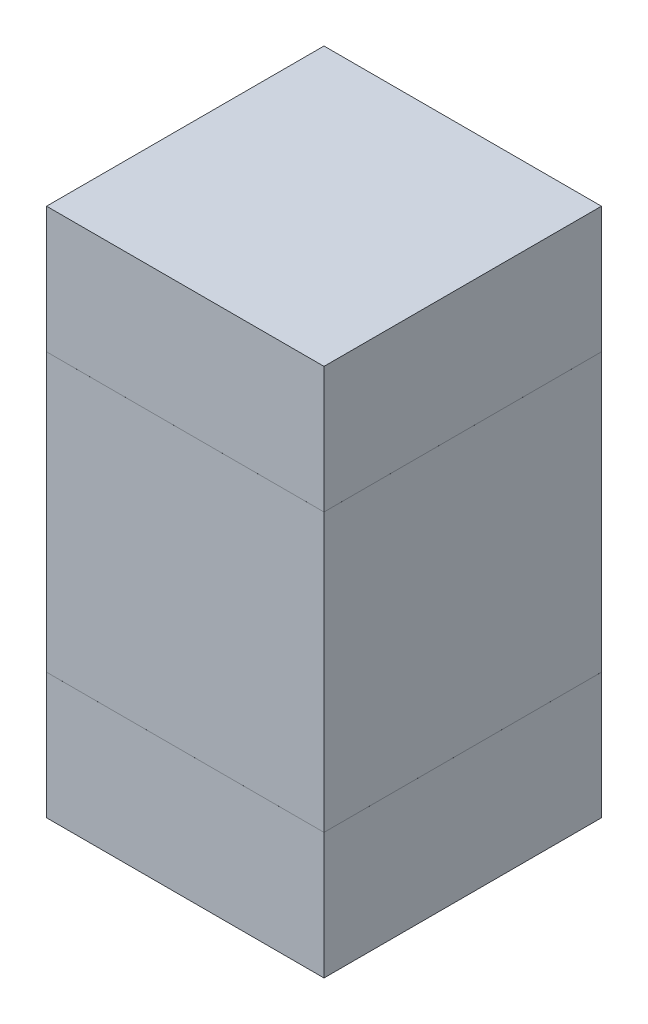
ISO-10303-21;
HEADER;
FILE_DESCRIPTION(('STEP AP214'),'2;1');
FILE_NAME('part.step','',(''),(''),'','','');
FILE_SCHEMA(('AUTOMOTIVE_DESIGN { 1 0 10303 214 1 1 1 1 }'));
ENDSEC;
DATA;
#1=APPLICATION_CONTEXT('core data for automotive mechanical design processes');
#2=APPLICATION_PROTOCOL_DEFINITION('international standard','automotive_design',2000,#1);
#3=PRODUCT_CONTEXT('',#1,'mechanical');
#4=PRODUCT('Part','Part','',(#3));
#5=PRODUCT_RELATED_PRODUCT_CATEGORY('part','',(#4));
#6=PRODUCT_DEFINITION_FORMATION('','',#4);
#7=PRODUCT_DEFINITION_CONTEXT('part definition',#1,'design');
#8=PRODUCT_DEFINITION('design','',#6,#7);
#9=PRODUCT_DEFINITION_SHAPE('','',#8);
#10=(LENGTH_UNIT() NAMED_UNIT(*) SI_UNIT(.MILLI.,.METRE.));
#11=(NAMED_UNIT(*) PLANE_ANGLE_UNIT() SI_UNIT($,.RADIAN.));
#12=(NAMED_UNIT(*) SI_UNIT($,.STERADIAN.) SOLID_ANGLE_UNIT());
#13=UNCERTAINTY_MEASURE_WITH_UNIT(LENGTH_MEASURE(1.E-05),#10,'distance_accuracy_value','');
#14=(GEOMETRIC_REPRESENTATION_CONTEXT(3) GLOBAL_UNCERTAINTY_ASSIGNED_CONTEXT((#13)) GLOBAL_UNIT_ASSIGNED_CONTEXT((#10,
#11,#12)) REPRESENTATION_CONTEXT('',''));
#15=CARTESIAN_POINT('',(0.,0.,0.));
#16=DIRECTION('',(0.,0.,1.));
#17=DIRECTION('',(1.,0.,0.));
#18=AXIS2_PLACEMENT_3D('',#15,#16,#17);
#19=CARTESIAN_POINT('',(1.810006232969,13.334994287031,0.32999934));
#20=DIRECTION('',(0.,0.,-1.));
#21=DIRECTION('',(0.,-1.,0.));
#22=AXIS2_PLACEMENT_3D('',#19,#20,#21);
#23=PLANE('',#22);
#24=DIRECTION('',(1.,0.,0.));
#25=VECTOR('',#24,1.);
#26=CARTESIAN_POINT('',(1.810006232969,13.334994287031,0.32999934));
#27=LINE('',#26,#25);
#28=CARTESIAN_POINT('',(1.810006232969,13.334994287031,0.32999934));
#29=VERTEX_POINT('',#28);
#30=CARTESIAN_POINT('',(2.140008112969,13.334994287031,0.32999934));
#31=VERTEX_POINT('',#30);
#32=EDGE_CURVE('P0_E75',#29,#31,#27,.T.);
#33=ORIENTED_EDGE('',*,*,#32,.T.);
#34=DIRECTION('',(0.,1.,0.));
#35=VECTOR('',#34,1.);
#36=CARTESIAN_POINT('',(2.140008112969,13.334994287031,0.32999934));
#37=LINE('',#36,#35);
#38=CARTESIAN_POINT('',(2.140008112969,13.484993987031,0.32999934));
#39=VERTEX_POINT('',#38);
#40=EDGE_CURVE('P0_E73',#31,#39,#37,.T.);
#41=ORIENTED_EDGE('',*,*,#40,.T.);
#42=DIRECTION('',(-1.,0.,0.));
#43=VECTOR('',#42,1.);
#44=CARTESIAN_POINT('',(2.140008112969,13.484993987031,0.32999934));
#45=LINE('',#44,#43);
#46=CARTESIAN_POINT('',(1.810006232969,13.484993987031,0.32999934));
#47=VERTEX_POINT('',#46);
#48=EDGE_CURVE('P0_E61',#39,#47,#45,.T.);
#49=ORIENTED_EDGE('',*,*,#48,.T.);
#50=DIRECTION('',(0.,-1.,0.));
#51=VECTOR('',#50,1.);
#52=CARTESIAN_POINT('',(1.810006232969,13.484993987031,0.32999934));
#53=LINE('',#52,#51);
#54=EDGE_CURVE('P0_E11',#47,#29,#53,.T.);
#55=ORIENTED_EDGE('',*,*,#54,.T.);
#56=EDGE_LOOP('',(#33,#41,#49,#55));
#57=FACE_BOUND('',#56,.T.);
#58=ADVANCED_FACE('P0_F17',(#57),#23,.F.);
#59=CARTESIAN_POINT('',(1.810006232969,13.334994287031,0.));
#60=DIRECTION('',(0.,0.,-1.));
#61=DIRECTION('',(0.,-1.,0.));
#62=AXIS2_PLACEMENT_3D('',#59,#60,#61);
#63=PLANE('',#62);
#64=DIRECTION('',(0.,-1.,0.));
#65=VECTOR('',#64,1.);
#66=CARTESIAN_POINT('',(1.810006232969,13.484993987031,0.));
#67=LINE('',#66,#65);
#68=CARTESIAN_POINT('',(1.810006232969,13.484993987031,0.));
#69=VERTEX_POINT('',#68);
#70=CARTESIAN_POINT('',(1.810006232969,13.334994287031,0.));
#71=VERTEX_POINT('',#70);
#72=EDGE_CURVE('P0_E20',#69,#71,#67,.T.);
#73=ORIENTED_EDGE('',*,*,#72,.F.);
#74=DIRECTION('',(-1.,0.,0.));
#75=VECTOR('',#74,1.);
#76=CARTESIAN_POINT('',(2.140008112969,13.484993987031,0.));
#77=LINE('',#76,#75);
#78=CARTESIAN_POINT('',(2.140008112969,13.484993987031,0.));
#79=VERTEX_POINT('',#78);
#80=EDGE_CURVE('P0_E80',#79,#69,#77,.T.);
#81=ORIENTED_EDGE('',*,*,#80,.F.);
#82=DIRECTION('',(0.,1.,0.));
#83=VECTOR('',#82,1.);
#84=CARTESIAN_POINT('',(2.140008112969,13.334994287031,0.));
#85=LINE('',#84,#83);
#86=CARTESIAN_POINT('',(2.140008112969,13.334994287031,0.));
#87=VERTEX_POINT('',#86);
#88=EDGE_CURVE('P0_E83',#87,#79,#85,.T.);
#89=ORIENTED_EDGE('',*,*,#88,.F.);
#90=DIRECTION('',(1.,0.,0.));
#91=VECTOR('',#90,1.);
#92=CARTESIAN_POINT('',(1.810006232969,13.334994287031,0.));
#93=LINE('',#92,#91);
#94=EDGE_CURVE('P0_E96',#71,#87,#93,.T.);
#95=ORIENTED_EDGE('',*,*,#94,.F.);
#96=EDGE_LOOP('',(#73,#81,#89,#95));
#97=FACE_BOUND('',#96,.T.);
#98=ADVANCED_FACE('P0_F112',(#97),#63,.T.);
#99=CARTESIAN_POINT('',(1.810006232969,13.484993987031,0.));
#100=DIRECTION('',(1.,0.,0.));
#101=DIRECTION('',(0.,1.,0.));
#102=AXIS2_PLACEMENT_3D('',#99,#100,#101);
#103=PLANE('',#102);
#104=ORIENTED_EDGE('',*,*,#72,.T.);
#105=DIRECTION('',(0.,0.,1.));
#106=VECTOR('',#105,1.);
#107=CARTESIAN_POINT('',(1.810006232969,13.334994287031,0.));
#108=LINE('',#107,#106);
#109=EDGE_CURVE('P0_E88',#71,#29,#108,.T.);
#110=ORIENTED_EDGE('',*,*,#109,.T.);
#111=ORIENTED_EDGE('',*,*,#54,.F.);
#112=DIRECTION('',(0.,0.,1.));
#113=VECTOR('',#112,1.);
#114=CARTESIAN_POINT('',(1.810006232969,13.484993987031,0.));
#115=LINE('',#114,#113);
#116=EDGE_CURVE('P0_E68',#69,#47,#115,.T.);
#117=ORIENTED_EDGE('',*,*,#116,.F.);
#118=EDGE_LOOP('',(#104,#110,#111,#117));
#119=FACE_BOUND('',#118,.T.);
#120=ADVANCED_FACE('P0_F117',(#119),#103,.F.);
#121=CARTESIAN_POINT('',(2.140008112969,13.484993987031,0.));
#122=DIRECTION('',(0.,-1.,0.));
#123=DIRECTION('',(0.,0.,-1.));
#124=AXIS2_PLACEMENT_3D('',#121,#122,#123);
#125=PLANE('',#124);
#126=ORIENTED_EDGE('',*,*,#80,.T.);
#127=ORIENTED_EDGE('',*,*,#116,.T.);
#128=ORIENTED_EDGE('',*,*,#48,.F.);
#129=DIRECTION('',(0.,0.,1.));
#130=VECTOR('',#129,1.);
#131=CARTESIAN_POINT('',(2.140008112969,13.484993987031,0.));
#132=LINE('',#131,#130);
#133=EDGE_CURVE('P0_E66',#79,#39,#132,.T.);
#134=ORIENTED_EDGE('',*,*,#133,.F.);
#135=EDGE_LOOP('',(#126,#127,#128,#134));
#136=FACE_BOUND('',#135,.T.);
#137=ADVANCED_FACE('P0_F64',(#136),#125,.F.);
#138=CARTESIAN_POINT('',(2.140008112969,13.334994287031,0.));
#139=DIRECTION('',(-1.,0.,0.));
#140=DIRECTION('',(0.,0.,1.));
#141=AXIS2_PLACEMENT_3D('',#138,#139,#140);
#142=PLANE('',#141);
#143=ORIENTED_EDGE('',*,*,#88,.T.);
#144=ORIENTED_EDGE('',*,*,#133,.T.);
#145=ORIENTED_EDGE('',*,*,#40,.F.);
#146=DIRECTION('',(0.,0.,1.));
#147=VECTOR('',#146,1.);
#148=CARTESIAN_POINT('',(2.140008112969,13.334994287031,0.));
#149=LINE('',#148,#147);
#150=EDGE_CURVE('P0_E93',#87,#31,#149,.T.);
#151=ORIENTED_EDGE('',*,*,#150,.F.);
#152=EDGE_LOOP('',(#143,#144,#145,#151));
#153=FACE_BOUND('',#152,.T.);
#154=ADVANCED_FACE('P0_F81',(#153),#142,.F.);
#155=CARTESIAN_POINT('',(1.810006232969,13.334994287031,0.));
#156=DIRECTION('',(0.,1.,0.));
#157=DIRECTION('',(1.,0.,0.));
#158=AXIS2_PLACEMENT_3D('',#155,#156,#157);
#159=PLANE('',#158);
#160=ORIENTED_EDGE('',*,*,#94,.T.);
#161=ORIENTED_EDGE('',*,*,#150,.T.);
#162=ORIENTED_EDGE('',*,*,#32,.F.);
#163=ORIENTED_EDGE('',*,*,#109,.F.);
#164=EDGE_LOOP('',(#160,#161,#162,#163));
#165=FACE_BOUND('',#164,.T.);
#166=ADVANCED_FACE('P0_F109',(#165),#159,.F.);
#167=CLOSED_SHELL('',(#58,#98,#120,#137,#154,#166));
#168=MANIFOLD_SOLID_BREP('P0_B1',#167);
#169=CARTESIAN_POINT('',(1.810006232969,13.815005273359,0.32999934));
#170=DIRECTION('',(0.,0.,-1.));
#171=DIRECTION('',(0.,-1.,0.));
#172=AXIS2_PLACEMENT_3D('',#169,#170,#171);
#173=PLANE('',#172);
#174=DIRECTION('',(1.,0.,0.));
#175=VECTOR('',#174,1.);
#176=CARTESIAN_POINT('',(1.810006232969,13.815005273359,0.32999934));
#177=LINE('',#176,#175);
#178=CARTESIAN_POINT('',(1.810006232969,13.815005273359,0.32999934));
#179=VERTEX_POINT('',#178);
#180=CARTESIAN_POINT('',(2.140008112969,13.815005273359,0.32999934));
#181=VERTEX_POINT('',#180);
#182=EDGE_CURVE('P1_E95',#179,#181,#177,.T.);
#183=ORIENTED_EDGE('',*,*,#182,.T.);
#184=DIRECTION('',(0.,1.,0.));
#185=VECTOR('',#184,1.);
#186=CARTESIAN_POINT('',(2.140008112969,13.815005273359,0.32999934));
#187=LINE('',#186,#185);
#188=CARTESIAN_POINT('',(2.140008112969,13.965004973359,0.32999934));
#189=VERTEX_POINT('',#188);
#190=EDGE_CURVE('P1_E75',#181,#189,#187,.T.);
#191=ORIENTED_EDGE('',*,*,#190,.T.);
#192=DIRECTION('',(-1.,0.,0.));
#193=VECTOR('',#192,1.);
#194=CARTESIAN_POINT('',(2.140008112969,13.965004973359,0.32999934));
#195=LINE('',#194,#193);
#196=CARTESIAN_POINT('',(1.810006232969,13.965004973359,0.32999934));
#197=VERTEX_POINT('',#196);
#198=EDGE_CURVE('P1_E80',#189,#197,#195,.T.);
#199=ORIENTED_EDGE('',*,*,#198,.T.);
#200=DIRECTION('',(0.,-1.,0.));
#201=VECTOR('',#200,1.);
#202=CARTESIAN_POINT('',(1.810006232969,13.965004973359,0.32999934));
#203=LINE('',#202,#201);
#204=EDGE_CURVE('P1_E11',#197,#179,#203,.T.);
#205=ORIENTED_EDGE('',*,*,#204,.T.);
#206=EDGE_LOOP('',(#183,#191,#199,#205));
#207=FACE_BOUND('',#206,.T.);
#208=ADVANCED_FACE('P1_F17',(#207),#173,.F.);
#209=CARTESIAN_POINT('',(1.810006232969,13.815005273359,0.));
#210=DIRECTION('',(0.,0.,-1.));
#211=DIRECTION('',(0.,-1.,0.));
#212=AXIS2_PLACEMENT_3D('',#209,#210,#211);
#213=PLANE('',#212);
#214=DIRECTION('',(0.,-1.,0.));
#215=VECTOR('',#214,1.);
#216=CARTESIAN_POINT('',(1.810006232969,13.965004973359,0.));
#217=LINE('',#216,#215);
#218=CARTESIAN_POINT('',(1.810006232969,13.965004973359,0.));
#219=VERTEX_POINT('',#218);
#220=CARTESIAN_POINT('',(1.810006232969,13.815005273359,0.));
#221=VERTEX_POINT('',#220);
#222=EDGE_CURVE('P1_E25',#219,#221,#217,.T.);
#223=ORIENTED_EDGE('',*,*,#222,.F.);
#224=DIRECTION('',(-1.,0.,0.));
#225=VECTOR('',#224,1.);
#226=CARTESIAN_POINT('',(2.140008112969,13.965004973359,0.));
#227=LINE('',#226,#225);
#228=CARTESIAN_POINT('',(2.140008112969,13.965004973359,0.));
#229=VERTEX_POINT('',#228);
#230=EDGE_CURVE('P1_E65',#229,#219,#227,.T.);
#231=ORIENTED_EDGE('',*,*,#230,.F.);
#232=DIRECTION('',(0.,1.,0.));
#233=VECTOR('',#232,1.);
#234=CARTESIAN_POINT('',(2.140008112969,13.815005273359,0.));
#235=LINE('',#234,#233);
#236=CARTESIAN_POINT('',(2.140008112969,13.815005273359,0.));
#237=VERTEX_POINT('',#236);
#238=EDGE_CURVE('P1_E69',#237,#229,#235,.T.);
#239=ORIENTED_EDGE('',*,*,#238,.F.);
#240=DIRECTION('',(1.,0.,0.));
#241=VECTOR('',#240,1.);
#242=CARTESIAN_POINT('',(1.810006232969,13.815005273359,0.));
#243=LINE('',#242,#241);
#244=EDGE_CURVE('P1_E110',#221,#237,#243,.T.);
#245=ORIENTED_EDGE('',*,*,#244,.F.);
#246=EDGE_LOOP('',(#223,#231,#239,#245));
#247=FACE_BOUND('',#246,.T.);
#248=ADVANCED_FACE('P1_F67',(#247),#213,.T.);
#249=CARTESIAN_POINT('',(1.810006232969,13.965004973359,0.));
#250=DIRECTION('',(1.,0.,0.));
#251=DIRECTION('',(0.,1.,0.));
#252=AXIS2_PLACEMENT_3D('',#249,#250,#251);
#253=PLANE('',#252);
#254=ORIENTED_EDGE('',*,*,#222,.T.);
#255=DIRECTION('',(0.,0.,1.));
#256=VECTOR('',#255,1.);
#257=CARTESIAN_POINT('',(1.810006232969,13.815005273359,0.));
#258=LINE('',#257,#256);
#259=EDGE_CURVE('P1_E90',#221,#179,#258,.T.);
#260=ORIENTED_EDGE('',*,*,#259,.T.);
#261=ORIENTED_EDGE('',*,*,#204,.F.);
#262=DIRECTION('',(0.,0.,1.));
#263=VECTOR('',#262,1.);
#264=CARTESIAN_POINT('',(1.810006232969,13.965004973359,0.));
#265=LINE('',#264,#263);
#266=EDGE_CURVE('P1_E74',#219,#197,#265,.T.);
#267=ORIENTED_EDGE('',*,*,#266,.F.);
#268=EDGE_LOOP('',(#254,#260,#261,#267));
#269=FACE_BOUND('',#268,.T.);
#270=ADVANCED_FACE('P1_F106',(#269),#253,.F.);
#271=CARTESIAN_POINT('',(2.140008112969,13.965004973359,0.));
#272=DIRECTION('',(0.,-1.,0.));
#273=DIRECTION('',(0.,0.,-1.));
#274=AXIS2_PLACEMENT_3D('',#271,#272,#273);
#275=PLANE('',#274);
#276=ORIENTED_EDGE('',*,*,#230,.T.);
#277=ORIENTED_EDGE('',*,*,#266,.T.);
#278=ORIENTED_EDGE('',*,*,#198,.F.);
#279=DIRECTION('',(0.,0.,1.));
#280=VECTOR('',#279,1.);
#281=CARTESIAN_POINT('',(2.140008112969,13.965004973359,0.));
#282=LINE('',#281,#280);
#283=EDGE_CURVE('P1_E78',#229,#189,#282,.T.);
#284=ORIENTED_EDGE('',*,*,#283,.F.);
#285=EDGE_LOOP('',(#276,#277,#278,#284));
#286=FACE_BOUND('',#285,.T.);
#287=ADVANCED_FACE('P1_F79',(#286),#275,.F.);
#288=CARTESIAN_POINT('',(2.140008112969,13.815005273359,0.));
#289=DIRECTION('',(-1.,0.,0.));
#290=DIRECTION('',(0.,0.,1.));
#291=AXIS2_PLACEMENT_3D('',#288,#289,#290);
#292=PLANE('',#291);
#293=ORIENTED_EDGE('',*,*,#238,.T.);
#294=ORIENTED_EDGE('',*,*,#283,.T.);
#295=ORIENTED_EDGE('',*,*,#190,.F.);
#296=DIRECTION('',(0.,0.,1.));
#297=VECTOR('',#296,1.);
#298=CARTESIAN_POINT('',(2.140008112969,13.815005273359,0.));
#299=LINE('',#298,#297);
#300=EDGE_CURVE('P1_E87',#237,#181,#299,.T.);
#301=ORIENTED_EDGE('',*,*,#300,.F.);
#302=EDGE_LOOP('',(#293,#294,#295,#301));
#303=FACE_BOUND('',#302,.T.);
#304=ADVANCED_FACE('P1_F85',(#303),#292,.F.);
#305=CARTESIAN_POINT('',(1.810006232969,13.815005273359,0.));
#306=DIRECTION('',(0.,1.,0.));
#307=DIRECTION('',(1.,0.,0.));
#308=AXIS2_PLACEMENT_3D('',#305,#306,#307);
#309=PLANE('',#308);
#310=ORIENTED_EDGE('',*,*,#244,.T.);
#311=ORIENTED_EDGE('',*,*,#300,.T.);
#312=ORIENTED_EDGE('',*,*,#182,.F.);
#313=ORIENTED_EDGE('',*,*,#259,.F.);
#314=EDGE_LOOP('',(#310,#311,#312,#313));
#315=FACE_BOUND('',#314,.T.);
#316=ADVANCED_FACE('P1_F109',(#315),#309,.F.);
#317=CLOSED_SHELL('',(#208,#248,#270,#287,#304,#316));
#318=MANIFOLD_SOLID_BREP('P1_B1',#317);
#319=CARTESIAN_POINT('',(1.810006232969,13.484999960195,0.32999934));
#320=DIRECTION('',(0.,0.,-1.));
#321=DIRECTION('',(0.,-1.,0.));
#322=AXIS2_PLACEMENT_3D('',#319,#320,#321);
#323=PLANE('',#322);
#324=DIRECTION('',(1.,0.,0.));
#325=VECTOR('',#324,1.);
#326=CARTESIAN_POINT('',(1.810006232969,13.484999960195,0.32999934));
#327=LINE('',#326,#325);
#328=CARTESIAN_POINT('',(1.810006232969,13.484999960195,0.32999934));
#329=VERTEX_POINT('',#328);
#330=CARTESIAN_POINT('',(2.140008112969,13.484999960195,0.32999934));
#331=VERTEX_POINT('',#330);
#332=EDGE_CURVE('P2_E81',#329,#331,#327,.T.);
#333=ORIENTED_EDGE('',*,*,#332,.T.);
#334=DIRECTION('',(0.,1.,0.));
#335=VECTOR('',#334,1.);
#336=CARTESIAN_POINT('',(2.140008112969,13.484999960195,0.32999934));
#337=LINE('',#336,#335);
#338=CARTESIAN_POINT('',(2.140008112969,13.814999300195,0.32999934));
#339=VERTEX_POINT('',#338);
#340=EDGE_CURVE('P2_E104',#331,#339,#337,.T.);
#341=ORIENTED_EDGE('',*,*,#340,.T.);
#342=DIRECTION('',(-1.,0.,0.));
#343=VECTOR('',#342,1.);
#344=CARTESIAN_POINT('',(2.140008112969,13.814999300195,0.32999934));
#345=LINE('',#344,#343);
#346=CARTESIAN_POINT('',(1.810006232969,13.814999300195,0.32999934));
#347=VERTEX_POINT('',#346);
#348=EDGE_CURVE('P2_E74',#339,#347,#345,.T.);
#349=ORIENTED_EDGE('',*,*,#348,.T.);
#350=DIRECTION('',(0.,-1.,0.));
#351=VECTOR('',#350,1.);
#352=CARTESIAN_POINT('',(1.810006232969,13.814999300195,0.32999934));
#353=LINE('',#352,#351);
#354=EDGE_CURVE('P2_E11',#347,#329,#353,.T.);
#355=ORIENTED_EDGE('',*,*,#354,.T.);
#356=EDGE_LOOP('',(#333,#341,#349,#355));
#357=FACE_BOUND('',#356,.T.);
#358=ADVANCED_FACE('P2_F17',(#357),#323,.F.);
#359=CARTESIAN_POINT('',(1.810006232969,13.484999960195,0.));
#360=DIRECTION('',(0.,0.,-1.));
#361=DIRECTION('',(0.,-1.,0.));
#362=AXIS2_PLACEMENT_3D('',#359,#360,#361);
#363=PLANE('',#362);
#364=DIRECTION('',(0.,-1.,0.));
#365=VECTOR('',#364,1.);
#366=CARTESIAN_POINT('',(1.810006232969,13.814999300195,0.));
#367=LINE('',#366,#365);
#368=CARTESIAN_POINT('',(1.810006232969,13.814999300195,0.));
#369=VERTEX_POINT('',#368);
#370=CARTESIAN_POINT('',(1.810006232969,13.484999960195,0.));
#371=VERTEX_POINT('',#370);
#372=EDGE_CURVE('P2_E20',#369,#371,#367,.T.);
#373=ORIENTED_EDGE('',*,*,#372,.F.);
#374=DIRECTION('',(-1.,0.,0.));
#375=VECTOR('',#374,1.);
#376=CARTESIAN_POINT('',(2.140008112969,13.814999300195,0.));
#377=LINE('',#376,#375);
#378=CARTESIAN_POINT('',(2.140008112969,13.814999300195,0.));
#379=VERTEX_POINT('',#378);
#380=EDGE_CURVE('P2_E101',#379,#369,#377,.T.);
#381=ORIENTED_EDGE('',*,*,#380,.F.);
#382=DIRECTION('',(0.,1.,0.));
#383=VECTOR('',#382,1.);
#384=CARTESIAN_POINT('',(2.140008112969,13.484999960195,0.));
#385=LINE('',#384,#383);
#386=CARTESIAN_POINT('',(2.140008112969,13.484999960195,0.));
#387=VERTEX_POINT('',#386);
#388=EDGE_CURVE('P2_E83',#387,#379,#385,.T.);
#389=ORIENTED_EDGE('',*,*,#388,.F.);
#390=DIRECTION('',(1.,0.,0.));
#391=VECTOR('',#390,1.);
#392=CARTESIAN_POINT('',(1.810006232969,13.484999960195,0.));
#393=LINE('',#392,#391);
#394=EDGE_CURVE('P2_E79',#371,#387,#393,.T.);
#395=ORIENTED_EDGE('',*,*,#394,.F.);
#396=EDGE_LOOP('',(#373,#381,#389,#395));
#397=FACE_BOUND('',#396,.T.);
#398=ADVANCED_FACE('P2_F85',(#397),#363,.T.);
#399=CARTESIAN_POINT('',(1.810006232969,13.814999300195,0.));
#400=DIRECTION('',(1.,0.,0.));
#401=DIRECTION('',(0.,1.,0.));
#402=AXIS2_PLACEMENT_3D('',#399,#400,#401);
#403=PLANE('',#402);
#404=ORIENTED_EDGE('',*,*,#372,.T.);
#405=DIRECTION('',(0.,0.,1.));
#406=VECTOR('',#405,1.);
#407=CARTESIAN_POINT('',(1.810006232969,13.484999960195,0.));
#408=LINE('',#407,#406);
#409=EDGE_CURVE('P2_E68',#371,#329,#408,.T.);
#410=ORIENTED_EDGE('',*,*,#409,.T.);
#411=ORIENTED_EDGE('',*,*,#354,.F.);
#412=DIRECTION('',(0.,0.,1.));
#413=VECTOR('',#412,1.);
#414=CARTESIAN_POINT('',(1.810006232969,13.814999300195,0.));
#415=LINE('',#414,#413);
#416=EDGE_CURVE('P2_E71',#369,#347,#415,.T.);
#417=ORIENTED_EDGE('',*,*,#416,.F.);
#418=EDGE_LOOP('',(#404,#410,#411,#417));
#419=FACE_BOUND('',#418,.T.);
#420=ADVANCED_FACE('P2_F67',(#419),#403,.F.);
#421=CARTESIAN_POINT('',(2.140008112969,13.814999300195,0.));
#422=DIRECTION('',(0.,-1.,0.));
#423=DIRECTION('',(0.,0.,-1.));
#424=AXIS2_PLACEMENT_3D('',#421,#422,#423);
#425=PLANE('',#424);
#426=ORIENTED_EDGE('',*,*,#380,.T.);
#427=ORIENTED_EDGE('',*,*,#416,.T.);
#428=ORIENTED_EDGE('',*,*,#348,.F.);
#429=DIRECTION('',(0.,0.,1.));
#430=VECTOR('',#429,1.);
#431=CARTESIAN_POINT('',(2.140008112969,13.814999300195,0.));
#432=LINE('',#431,#430);
#433=EDGE_CURVE('P2_E100',#379,#339,#432,.T.);
#434=ORIENTED_EDGE('',*,*,#433,.F.);
#435=EDGE_LOOP('',(#426,#427,#428,#434));
#436=FACE_BOUND('',#435,.T.);
#437=ADVANCED_FACE('P2_F118',(#436),#425,.F.);
#438=CARTESIAN_POINT('',(2.140008112969,13.484999960195,0.));
#439=DIRECTION('',(-1.,0.,0.));
#440=DIRECTION('',(0.,0.,1.));
#441=AXIS2_PLACEMENT_3D('',#438,#439,#440);
#442=PLANE('',#441);
#443=ORIENTED_EDGE('',*,*,#388,.T.);
#444=ORIENTED_EDGE('',*,*,#433,.T.);
#445=ORIENTED_EDGE('',*,*,#340,.F.);
#446=DIRECTION('',(0.,0.,1.));
#447=VECTOR('',#446,1.);
#448=CARTESIAN_POINT('',(2.140008112969,13.484999960195,0.));
#449=LINE('',#448,#447);
#450=EDGE_CURVE('P2_E89',#387,#331,#449,.T.);
#451=ORIENTED_EDGE('',*,*,#450,.F.);
#452=EDGE_LOOP('',(#443,#444,#445,#451));
#453=FACE_BOUND('',#452,.T.);
#454=ADVANCED_FACE('P2_F120',(#453),#442,.F.);
#455=CARTESIAN_POINT('',(1.810006232969,13.484999960195,0.));
#456=DIRECTION('',(0.,1.,0.));
#457=DIRECTION('',(1.,0.,0.));
#458=AXIS2_PLACEMENT_3D('',#455,#456,#457);
#459=PLANE('',#458);
#460=ORIENTED_EDGE('',*,*,#394,.T.);
#461=ORIENTED_EDGE('',*,*,#450,.T.);
#462=ORIENTED_EDGE('',*,*,#332,.F.);
#463=ORIENTED_EDGE('',*,*,#409,.F.);
#464=EDGE_LOOP('',(#460,#461,#462,#463));
#465=FACE_BOUND('',#464,.T.);
#466=ADVANCED_FACE('P2_F77',(#465),#459,.F.);
#467=CLOSED_SHELL('',(#358,#398,#420,#437,#454,#466));
#468=MANIFOLD_SOLID_BREP('P2_B1',#467);
#469=ADVANCED_BREP_SHAPE_REPRESENTATION('',(#18,#168,#318,#468),#14);
#470=SHAPE_DEFINITION_REPRESENTATION(#9,#469);
ENDSEC;
END-ISO-10303-21;
